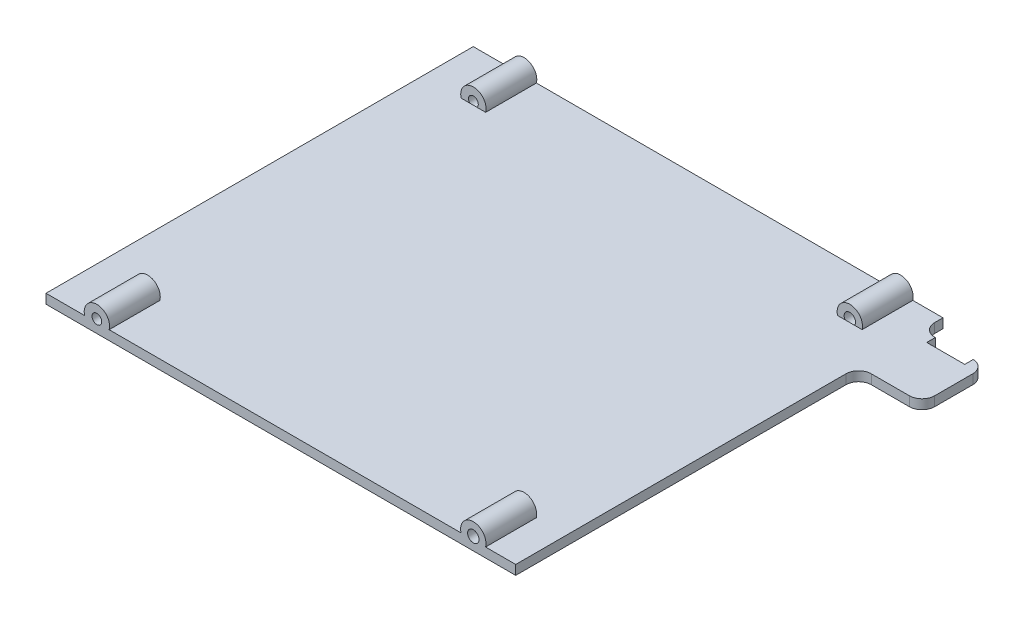
ISO-10303-21;
HEADER;
FILE_DESCRIPTION(('STEP AP214'),'2;1');
FILE_NAME('part.step','',(''),(''),'','','');
FILE_SCHEMA(('AUTOMOTIVE_DESIGN { 1 0 10303 214 1 1 1 1 }'));
ENDSEC;
DATA;
#1=APPLICATION_CONTEXT('core data for automotive mechanical design processes');
#2=APPLICATION_PROTOCOL_DEFINITION('international standard','automotive_design',2000,#1);
#3=PRODUCT_CONTEXT('',#1,'mechanical');
#4=PRODUCT('Part','Part','',(#3));
#5=PRODUCT_RELATED_PRODUCT_CATEGORY('part','',(#4));
#6=PRODUCT_DEFINITION_FORMATION('','',#4);
#7=PRODUCT_DEFINITION_CONTEXT('part definition',#1,'design');
#8=PRODUCT_DEFINITION('design','',#6,#7);
#9=PRODUCT_DEFINITION_SHAPE('','',#8);
#10=(LENGTH_UNIT() NAMED_UNIT(*) SI_UNIT(.MILLI.,.METRE.));
#11=(NAMED_UNIT(*) PLANE_ANGLE_UNIT() SI_UNIT($,.RADIAN.));
#12=(NAMED_UNIT(*) SI_UNIT($,.STERADIAN.) SOLID_ANGLE_UNIT());
#13=UNCERTAINTY_MEASURE_WITH_UNIT(LENGTH_MEASURE(1.E-05),#10,'distance_accuracy_value','');
#14=(GEOMETRIC_REPRESENTATION_CONTEXT(3) GLOBAL_UNCERTAINTY_ASSIGNED_CONTEXT((#13)) GLOBAL_UNIT_ASSIGNED_CONTEXT((#10,
#11,#12)) REPRESENTATION_CONTEXT('',''));
#15=CARTESIAN_POINT('',(0.,0.,0.));
#16=DIRECTION('',(0.,0.,1.));
#17=DIRECTION('',(1.,0.,0.));
#18=AXIS2_PLACEMENT_3D('',#15,#16,#17);
#19=CARTESIAN_POINT('',(-85.5905303741347,-18.8675075749451,-141.472563016622));
#20=DIRECTION('',(-1.,0.,0.));
#21=DIRECTION('',(0.,-1.,0.));
#22=AXIS2_PLACEMENT_3D('',#19,#20,#21);
#23=PLANE('',#22);
#24=DIRECTION('',(0.,0.999999944421007,0.000333403635094687));
#25=VECTOR('',#24,1.);
#26=CARTESIAN_POINT('',(-85.5905303741347,-20.3675075749451,-52.0805001054825));
#27=LINE('',#26,#25);
#28=CARTESIAN_POINT('',(-85.5905303741347,-20.3675075749451,-52.0805001054825));
#29=VERTEX_POINT('',#28);
#30=CARTESIAN_POINT('',(-85.5905303741347,-18.8675075749451,-52.080000000002));
#31=VERTEX_POINT('',#30);
#32=EDGE_CURVE('E253',#29,#31,#27,.T.);
#33=ORIENTED_EDGE('',*,*,#32,.T.);
#34=DIRECTION('',(0.,0.,1.));
#35=VECTOR('',#34,1.);
#36=CARTESIAN_POINT('',(-85.5905303741347,-18.8675075749451,-141.472563016622));
#37=LINE('',#36,#35);
#38=CARTESIAN_POINT('',(-85.5905303741347,-18.8675075749451,0.));
#39=VERTEX_POINT('',#38);
#40=EDGE_CURVE('E387',#31,#39,#37,.T.);
#41=ORIENTED_EDGE('',*,*,#40,.T.);
#42=DIRECTION('',(0.,1.,0.));
#43=VECTOR('',#42,1.);
#44=CARTESIAN_POINT('',(-85.5905303741347,-18.8675075749451,0.));
#45=LINE('',#44,#43);
#46=CARTESIAN_POINT('',(-85.5905303741347,-20.3675075749451,0.));
#47=VERTEX_POINT('',#46);
#48=EDGE_CURVE('E384',#47,#39,#45,.T.);
#49=ORIENTED_EDGE('',*,*,#48,.F.);
#50=DIRECTION('',(0.,0.,1.));
#51=VECTOR('',#50,1.);
#52=CARTESIAN_POINT('',(-85.5905303741347,-20.3675075749451,-141.472563016622));
#53=LINE('',#52,#51);
#54=EDGE_CURVE('E391',#29,#47,#53,.T.);
#55=ORIENTED_EDGE('',*,*,#54,.F.);
#56=EDGE_LOOP('',(#33,#41,#49,#55));
#57=FACE_BOUND('',#56,.T.);
#58=ADVANCED_FACE('F41',(#57),#23,.F.);
#59=CARTESIAN_POINT('',(-159.667908124511,-18.8675075749451,-141.472563016622));
#60=DIRECTION('',(0.,-1.,0.));
#61=DIRECTION('',(1.,0.,0.));
#62=AXIS2_PLACEMENT_3D('',#59,#60,#61);
#63=PLANE('',#62);
#64=DIRECTION('',(1.,0.,0.));
#65=VECTOR('',#64,1.);
#66=CARTESIAN_POINT('',(-159.667908124511,-18.8675075749451,-62.7311529803631));
#67=LINE('',#66,#65);
#68=CARTESIAN_POINT('',(-83.4954652130825,-18.8675075749451,-62.7311529803631));
#69=VERTEX_POINT('',#68);
#70=CARTESIAN_POINT('',(-77.5092926086521,-18.8675075749451,-62.7311529803631));
#71=VERTEX_POINT('',#70);
#72=EDGE_CURVE('E251',#69,#71,#67,.T.);
#73=ORIENTED_EDGE('',*,*,#72,.F.);
#74=DIRECTION('',(0.,0.,1.));
#75=VECTOR('',#74,1.);
#76=CARTESIAN_POINT('',(-83.4954652130825,-18.8675075749451,-141.472563016622));
#77=LINE('',#76,#75);
#78=CARTESIAN_POINT('',(-83.4954652130825,-18.8675075749449,-64.0800000000012));
#79=VERTEX_POINT('',#78);
#80=EDGE_CURVE('E227',#79,#69,#77,.T.);
#81=ORIENTED_EDGE('',*,*,#80,.F.);
#82=DIRECTION('',(-1.,0.,0.));
#83=VECTOR('',#82,1.);
#84=CARTESIAN_POINT('',(-33.147999999999,-18.8675075749446,-64.0800000000013));
#85=LINE('',#84,#83);
#86=CARTESIAN_POINT('',(-83.5905303741347,-18.8675075749451,-64.0800000000012));
#87=VERTEX_POINT('',#86);
#88=EDGE_CURVE('E270',#79,#87,#85,.T.);
#89=ORIENTED_EDGE('',*,*,#88,.T.);
#90=CARTESIAN_POINT('',(-83.5905303741347,-18.8675075749451,-66.0800000000012));
#91=DIRECTION('',(0.,1.,0.));
#92=DIRECTION('',(1.,0.,0.));
#93=AXIS2_PLACEMENT_3D('',#90,#91,#92);
#94=CIRCLE('',#93,2.);
#95=CARTESIAN_POINT('',(-85.5905303741347,-18.8675075749451,-66.0800000000012));
#96=VERTEX_POINT('',#95);
#97=EDGE_CURVE('E278',#96,#87,#94,.T.);
#98=ORIENTED_EDGE('',*,*,#97,.F.);
#99=CARTESIAN_POINT('',(-85.5905303741347,-18.8675075749451,-67.3800000000012));
#100=VERTEX_POINT('',#99);
#101=EDGE_CURVE('E406',#100,#96,#37,.T.);
#102=ORIENTED_EDGE('',*,*,#101,.F.);
#103=DIRECTION('',(-1.,0.,0.));
#104=VECTOR('',#103,1.);
#105=CARTESIAN_POINT('',(-159.667908124511,-18.8675075749451,-67.3800000000011));
#106=LINE('',#105,#104);
#107=CARTESIAN_POINT('',(-90.343870425704,-18.8675075749451,-67.3800000000013));
#108=VERTEX_POINT('',#107);
#109=EDGE_CURVE('E392',#100,#108,#106,.T.);
#110=ORIENTED_EDGE('',*,*,#109,.T.);
#111=DIRECTION('',(0.,0.,-1.));
#112=VECTOR('',#111,1.);
#113=CARTESIAN_POINT('',(-90.343870425704,-18.8675075749451,-59.3800000000013));
#114=LINE('',#113,#112);
#115=CARTESIAN_POINT('',(-90.343870425704,-18.8675075749451,-59.3800000000013));
#116=VERTEX_POINT('',#115);
#117=EDGE_CURVE('E325',#108,#116,#114,.F.);
#118=ORIENTED_EDGE('',*,*,#117,.T.);
#119=DIRECTION('',(1.,0.,0.));
#120=VECTOR('',#119,1.);
#121=CARTESIAN_POINT('',(-159.667908124511,-18.8675075749451,-59.3800000000013));
#122=LINE('',#121,#120);
#123=CARTESIAN_POINT('',(-91.5320306214525,-18.8675075749451,-59.3800000000013));
#124=VERTEX_POINT('',#123);
#125=EDGE_CURVE('E334',#124,#116,#122,.T.);
#126=ORIENTED_EDGE('',*,*,#125,.F.);
#127=CARTESIAN_POINT('',(-93.028693576163,-18.8675075749451,-59.3800000000013));
#128=VERTEX_POINT('',#127);
#129=EDGE_CURVE('E339',#128,#124,#122,.T.);
#130=ORIENTED_EDGE('',*,*,#129,.F.);
#131=CARTESIAN_POINT('',(-94.216853771912,-18.8675075749451,-59.3800000000013));
#132=VERTEX_POINT('',#131);
#133=EDGE_CURVE('E335',#132,#128,#122,.T.);
#134=ORIENTED_EDGE('',*,*,#133,.F.);
#135=DIRECTION('',(0.,0.,-1.));
#136=VECTOR('',#135,1.);
#137=CARTESIAN_POINT('',(-94.216853771912,-18.8675075749451,-59.3800000000013));
#138=LINE('',#137,#136);
#139=CARTESIAN_POINT('',(-94.216853771912,-18.8675075749451,-67.3800000000012));
#140=VERTEX_POINT('',#139);
#141=EDGE_CURVE('E317',#132,#140,#138,.T.);
#142=ORIENTED_EDGE('',*,*,#141,.T.);
#143=CARTESIAN_POINT('',(-149.708016259504,-18.8675075749451,-67.3800000000013));
#144=VERTEX_POINT('',#143);
#145=EDGE_CURVE('E396',#140,#144,#106,.T.);
#146=ORIENTED_EDGE('',*,*,#145,.T.);
#147=DIRECTION('',(0.,0.,-1.));
#148=VECTOR('',#147,1.);
#149=CARTESIAN_POINT('',(-149.708016259504,-18.8675075749451,-59.3800000000013));
#150=LINE('',#149,#148);
#151=CARTESIAN_POINT('',(-149.708016259504,-18.8675075749451,-59.3800000000013));
#152=VERTEX_POINT('',#151);
#153=EDGE_CURVE('E331',#144,#152,#150,.F.);
#154=ORIENTED_EDGE('',*,*,#153,.T.);
#155=DIRECTION('',(1.,0.,0.));
#156=VECTOR('',#155,1.);
#157=CARTESIAN_POINT('',(-159.667908124511,-18.8675075749451,-59.3800000000013));
#158=LINE('',#157,#156);
#159=CARTESIAN_POINT('',(-151.059398233736,-18.8675075749451,-59.3800000000013));
#160=VERTEX_POINT('',#159);
#161=EDGE_CURVE('E338',#160,#152,#158,.T.);
#162=ORIENTED_EDGE('',*,*,#161,.F.);
#163=CARTESIAN_POINT('',(-152.22961763148,-18.8675075749451,-59.3800000000013));
#164=VERTEX_POINT('',#163);
#165=EDGE_CURVE('E344',#164,#160,#158,.T.);
#166=ORIENTED_EDGE('',*,*,#165,.F.);
#167=CARTESIAN_POINT('',(-153.580999605713,-18.8675075749451,-59.3800000000013));
#168=VERTEX_POINT('',#167);
#169=EDGE_CURVE('E340',#168,#164,#158,.T.);
#170=ORIENTED_EDGE('',*,*,#169,.F.);
#171=DIRECTION('',(0.,0.,-1.));
#172=VECTOR('',#171,1.);
#173=CARTESIAN_POINT('',(-153.580999605713,-18.8675075749451,-59.3800000000013));
#174=LINE('',#173,#172);
#175=CARTESIAN_POINT('',(-153.580999605713,-18.8675075749451,-67.3800000000011));
#176=VERTEX_POINT('',#175);
#177=EDGE_CURVE('E328',#168,#176,#174,.T.);
#178=ORIENTED_EDGE('',*,*,#177,.T.);
#179=CARTESIAN_POINT('',(-159.667908124511,-18.8675075749451,-67.3800000000011));
#180=VERTEX_POINT('',#179);
#181=EDGE_CURVE('E397',#176,#180,#106,.T.);
#182=ORIENTED_EDGE('',*,*,#181,.T.);
#183=DIRECTION('',(0.,0.,1.));
#184=VECTOR('',#183,1.);
#185=CARTESIAN_POINT('',(-159.667908124511,-18.8675075749451,-141.472563016622));
#186=LINE('',#185,#184);
#187=CARTESIAN_POINT('',(-159.667908124511,-18.8675075749451,0.));
#188=VERTEX_POINT('',#187);
#189=EDGE_CURVE('E378',#180,#188,#186,.T.);
#190=ORIENTED_EDGE('',*,*,#189,.T.);
#191=DIRECTION('',(-1.,0.,0.));
#192=VECTOR('',#191,1.);
#193=CARTESIAN_POINT('',(-159.667908124511,-18.8675075749451,0.));
#194=LINE('',#193,#192);
#195=CARTESIAN_POINT('',(-153.580999605712,-18.8675075749451,0.));
#196=VERTEX_POINT('',#195);
#197=EDGE_CURVE('E383',#196,#188,#194,.T.);
#198=ORIENTED_EDGE('',*,*,#197,.F.);
#199=DIRECTION('',(0.,0.,1.));
#200=VECTOR('',#199,1.);
#201=CARTESIAN_POINT('',(-153.580999605712,-18.8675075749451,-8.));
#202=LINE('',#201,#200);
#203=CARTESIAN_POINT('',(-153.580999605712,-18.8675075749451,-8.));
#204=VERTEX_POINT('',#203);
#205=EDGE_CURVE('E371',#196,#204,#202,.F.);
#206=ORIENTED_EDGE('',*,*,#205,.T.);
#207=DIRECTION('',(-1.,0.,0.));
#208=VECTOR('',#207,1.);
#209=CARTESIAN_POINT('',(-159.667908124511,-18.8675075749451,-8.00000000000001));
#210=LINE('',#209,#208);
#211=CARTESIAN_POINT('',(-152.22961763148,-18.8675075749451,-8.));
#212=VERTEX_POINT('',#211);
#213=EDGE_CURVE('E416',#212,#204,#210,.T.);
#214=ORIENTED_EDGE('',*,*,#213,.F.);
#215=CARTESIAN_POINT('',(-151.059398233736,-18.8675075749451,-8.));
#216=VERTEX_POINT('',#215);
#217=EDGE_CURVE('E422',#216,#212,#210,.T.);
#218=ORIENTED_EDGE('',*,*,#217,.F.);
#219=CARTESIAN_POINT('',(-149.708016259504,-18.8675075749451,-8.));
#220=VERTEX_POINT('',#219);
#221=EDGE_CURVE('E418',#220,#216,#210,.T.);
#222=ORIENTED_EDGE('',*,*,#221,.F.);
#223=DIRECTION('',(0.,0.,1.));
#224=VECTOR('',#223,1.);
#225=CARTESIAN_POINT('',(-149.708016259504,-18.8675075749451,-8.));
#226=LINE('',#225,#224);
#227=CARTESIAN_POINT('',(-149.708016259504,-18.8675075749451,0.));
#228=VERTEX_POINT('',#227);
#229=EDGE_CURVE('E368',#220,#228,#226,.T.);
#230=ORIENTED_EDGE('',*,*,#229,.T.);
#231=CARTESIAN_POINT('',(-94.2168537719112,-18.8675075749451,0.));
#232=VERTEX_POINT('',#231);
#233=EDGE_CURVE('E382',#232,#228,#194,.T.);
#234=ORIENTED_EDGE('',*,*,#233,.F.);
#235=DIRECTION('',(0.,0.,1.));
#236=VECTOR('',#235,1.);
#237=CARTESIAN_POINT('',(-94.2168537719112,-18.8675075749451,-8.));
#238=LINE('',#237,#236);
#239=CARTESIAN_POINT('',(-94.2168537719112,-18.8675075749451,-8.));
#240=VERTEX_POINT('',#239);
#241=EDGE_CURVE('E365',#232,#240,#238,.F.);
#242=ORIENTED_EDGE('',*,*,#241,.T.);
#243=DIRECTION('',(-1.,0.,0.));
#244=VECTOR('',#243,1.);
#245=CARTESIAN_POINT('',(-159.667908124511,-18.8675075749451,-8.00000000000001));
#246=LINE('',#245,#244);
#247=CARTESIAN_POINT('',(-93.0286935761624,-18.8675075749451,-8.));
#248=VERTEX_POINT('',#247);
#249=EDGE_CURVE('E395',#248,#240,#246,.T.);
#250=ORIENTED_EDGE('',*,*,#249,.F.);
#251=CARTESIAN_POINT('',(-91.5320306214526,-18.8675075749451,-8.));
#252=VERTEX_POINT('',#251);
#253=EDGE_CURVE('E417',#252,#248,#246,.T.);
#254=ORIENTED_EDGE('',*,*,#253,.F.);
#255=CARTESIAN_POINT('',(-90.3438704257039,-18.8675075749451,-8.));
#256=VERTEX_POINT('',#255);
#257=EDGE_CURVE('E413',#256,#252,#246,.T.);
#258=ORIENTED_EDGE('',*,*,#257,.F.);
#259=DIRECTION('',(0.,0.,1.));
#260=VECTOR('',#259,1.);
#261=CARTESIAN_POINT('',(-90.3438704257039,-18.8675075749451,-8.));
#262=LINE('',#261,#260);
#263=CARTESIAN_POINT('',(-90.3438704257039,-18.8675075749451,0.));
#264=VERTEX_POINT('',#263);
#265=EDGE_CURVE('E357',#256,#264,#262,.T.);
#266=ORIENTED_EDGE('',*,*,#265,.T.);
#267=EDGE_CURVE('E379',#39,#264,#194,.T.);
#268=ORIENTED_EDGE('',*,*,#267,.F.);
#269=ORIENTED_EDGE('',*,*,#40,.F.);
#270=CARTESIAN_POINT('',(-83.5905303741347,-18.8675075749451,-52.0800000000021));
#271=DIRECTION('',(0.,1.,0.));
#272=DIRECTION('',(1.,0.,0.));
#273=AXIS2_PLACEMENT_3D('',#270,#271,#272);
#274=CIRCLE('',#273,2.);
#275=CARTESIAN_POINT('',(-83.5905303741347,-18.8675075749451,-54.0800000000021));
#276=VERTEX_POINT('',#275);
#277=EDGE_CURVE('E63',#276,#31,#274,.T.);
#278=ORIENTED_EDGE('',*,*,#277,.F.);
#279=DIRECTION('',(1.,0.,0.));
#280=VECTOR('',#279,1.);
#281=CARTESIAN_POINT('',(-33.1479999999989,-18.8675075749446,-54.0800000000021));
#282=LINE('',#281,#280);
#283=CARTESIAN_POINT('',(-77.5905303741347,-18.867507574945,-54.0800000000021));
#284=VERTEX_POINT('',#283);
#285=EDGE_CURVE('E258',#276,#284,#282,.T.);
#286=ORIENTED_EDGE('',*,*,#285,.T.);
#287=CARTESIAN_POINT('',(-77.5905303741347,-18.867507574945,-56.0800000000021));
#288=DIRECTION('',(0.,1.,0.));
#289=DIRECTION('',(1.,0.,0.));
#290=AXIS2_PLACEMENT_3D('',#287,#288,#289);
#291=CIRCLE('',#290,2.);
#292=CARTESIAN_POINT('',(-75.5905303741347,-18.867507574945,-56.0800000000021));
#293=VERTEX_POINT('',#292);
#294=EDGE_CURVE('E261',#284,#293,#291,.T.);
#295=ORIENTED_EDGE('',*,*,#294,.T.);
#296=DIRECTION('',(0.,0.,-1.));
#297=VECTOR('',#296,1.);
#298=CARTESIAN_POINT('',(-75.5905303741347,-18.867507574945,-52.080000000002));
#299=LINE('',#298,#297);
#300=CARTESIAN_POINT('',(-75.5905303741347,-18.867507574945,-62.0800000000012));
#301=VERTEX_POINT('',#300);
#302=EDGE_CURVE('E264',#293,#301,#299,.T.);
#303=ORIENTED_EDGE('',*,*,#302,.T.);
#304=CARTESIAN_POINT('',(-77.5905303741347,-18.867507574945,-62.0800000000012));
#305=DIRECTION('',(0.,1.,0.));
#306=DIRECTION('',(1.,0.,0.));
#307=AXIS2_PLACEMENT_3D('',#304,#305,#306);
#308=CIRCLE('',#307,2.);
#309=CARTESIAN_POINT('',(-77.5092926086521,-18.8675075749449,-64.0783494252668));
#310=VERTEX_POINT('',#309);
#311=EDGE_CURVE('E267',#301,#310,#308,.T.);
#312=ORIENTED_EDGE('',*,*,#311,.T.);
#313=DIRECTION('',(0.,0.,-1.));
#314=VECTOR('',#313,1.);
#315=CARTESIAN_POINT('',(-77.5092926086521,-18.8675075749451,-141.472563016622));
#316=LINE('',#315,#314);
#317=EDGE_CURVE('E247',#71,#310,#316,.T.);
#318=ORIENTED_EDGE('',*,*,#317,.F.);
#319=EDGE_LOOP('',(#73,#81,#89,#98,#102,#110,#118,#126,#130,#134,#142,#146,#154,#162,#166,#170,
#178,#182,#190,#198,#206,#214,#218,#222,#230,#234,#242,#250,#254,#258,#266,#268,#269,#278,#286,
#295,#303,#312,#318));
#320=FACE_BOUND('',#319,.T.);
#321=ADVANCED_FACE('F440',(#320),#63,.F.);
#322=CARTESIAN_POINT('',(-85.5905303741347,-20.3675075749451,-141.472563016622));
#323=DIRECTION('',(0.,1.,0.));
#324=DIRECTION('',(-1.,0.,0.));
#325=AXIS2_PLACEMENT_3D('',#322,#323,#324);
#326=PLANE('',#325);
#327=CARTESIAN_POINT('',(-77.5905303741347,-20.3675075749451,-62.0800000000012));
#328=DIRECTION('',(0.,-1.,0.));
#329=DIRECTION('',(-1.,0.,0.));
#330=AXIS2_PLACEMENT_3D('',#327,#328,#329);
#331=CIRCLE('',#330,2.);
#332=CARTESIAN_POINT('',(-77.5092926086521,-20.3675075749451,-64.0783494252668));
#333=VERTEX_POINT('',#332);
#334=CARTESIAN_POINT('',(-75.5905303741347,-20.3675075749451,-62.0800000000012));
#335=VERTEX_POINT('',#334);
#336=EDGE_CURVE('E284',#333,#335,#331,.T.);
#337=ORIENTED_EDGE('',*,*,#336,.T.);
#338=DIRECTION('',(0.,0.,1.));
#339=VECTOR('',#338,1.);
#340=CARTESIAN_POINT('',(-75.5905303741347,-20.3675075749451,-64.0800000000021));
#341=LINE('',#340,#339);
#342=CARTESIAN_POINT('',(-75.5905303741347,-20.3675075749451,-56.0800000000021));
#343=VERTEX_POINT('',#342);
#344=EDGE_CURVE('E286',#335,#343,#341,.T.);
#345=ORIENTED_EDGE('',*,*,#344,.T.);
#346=CARTESIAN_POINT('',(-77.5905303741347,-20.3675075749451,-56.0800000000021));
#347=DIRECTION('',(0.,-1.,0.));
#348=DIRECTION('',(-1.,0.,0.));
#349=AXIS2_PLACEMENT_3D('',#346,#347,#348);
#350=CIRCLE('',#349,2.);
#351=CARTESIAN_POINT('',(-77.5905303741347,-20.3675075749451,-54.0800000000021));
#352=VERTEX_POINT('',#351);
#353=EDGE_CURVE('E273',#343,#352,#350,.T.);
#354=ORIENTED_EDGE('',*,*,#353,.T.);
#355=DIRECTION('',(-1.,0.,0.));
#356=VECTOR('',#355,1.);
#357=CARTESIAN_POINT('',(-75.5905303741347,-20.3675075749451,-54.0800000000021));
#358=LINE('',#357,#356);
#359=CARTESIAN_POINT('',(-83.5905303741347,-20.3675075749451,-54.0800000000021));
#360=VERTEX_POINT('',#359);
#361=EDGE_CURVE('E277',#352,#360,#358,.T.);
#362=ORIENTED_EDGE('',*,*,#361,.T.);
#363=CARTESIAN_POINT('',(-83.5905303741347,-20.3675075749451,-52.0800000000021));
#364=DIRECTION('',(0.,-1.,0.));
#365=DIRECTION('',(-1.,0.,0.));
#366=AXIS2_PLACEMENT_3D('',#363,#364,#365);
#367=CIRCLE('',#366,2.);
#368=EDGE_CURVE('E274',#29,#360,#367,.T.);
#369=ORIENTED_EDGE('',*,*,#368,.F.);
#370=ORIENTED_EDGE('',*,*,#54,.T.);
#371=DIRECTION('',(1.,0.,0.));
#372=VECTOR('',#371,1.);
#373=CARTESIAN_POINT('',(-85.5905303741347,-20.3675075749451,0.));
#374=LINE('',#373,#372);
#375=CARTESIAN_POINT('',(-159.667908124511,-20.3675075749451,0.));
#376=VERTEX_POINT('',#375);
#377=EDGE_CURVE('E389',#376,#47,#374,.T.);
#378=ORIENTED_EDGE('',*,*,#377,.F.);
#379=DIRECTION('',(0.,0.,1.));
#380=VECTOR('',#379,1.);
#381=CARTESIAN_POINT('',(-159.667908124511,-20.3675075749451,-141.472563016622));
#382=LINE('',#381,#380);
#383=CARTESIAN_POINT('',(-159.667908124511,-20.3675075749451,-67.3800000000011));
#384=VERTEX_POINT('',#383);
#385=EDGE_CURVE('E374',#384,#376,#382,.T.);
#386=ORIENTED_EDGE('',*,*,#385,.F.);
#387=DIRECTION('',(1.,0.,0.));
#388=VECTOR('',#387,1.);
#389=CARTESIAN_POINT('',(-85.5905303741346,-20.3675075749451,-67.3800000000012));
#390=LINE('',#389,#388);
#391=CARTESIAN_POINT('',(-85.5905303741347,-20.3675075749451,-67.3800000000012));
#392=VERTEX_POINT('',#391);
#393=EDGE_CURVE('E400',#384,#392,#390,.T.);
#394=ORIENTED_EDGE('',*,*,#393,.T.);
#395=CARTESIAN_POINT('',(-85.5905303741347,-20.3675075749451,-66.0800000000012));
#396=VERTEX_POINT('',#395);
#397=EDGE_CURVE('E388',#392,#396,#53,.T.);
#398=ORIENTED_EDGE('',*,*,#397,.T.);
#399=CARTESIAN_POINT('',(-83.5905303741347,-20.3675075749451,-66.0800000000012));
#400=DIRECTION('',(0.,-1.,0.));
#401=DIRECTION('',(-1.,0.,0.));
#402=AXIS2_PLACEMENT_3D('',#399,#400,#401);
#403=CIRCLE('',#402,2.);
#404=CARTESIAN_POINT('',(-83.5905303741347,-20.3675075749451,-64.080000000002));
#405=VERTEX_POINT('',#404);
#406=EDGE_CURVE('E281',#396,#405,#403,.F.);
#407=ORIENTED_EDGE('',*,*,#406,.T.);
#408=DIRECTION('',(1.,0.,0.));
#409=VECTOR('',#408,1.);
#410=CARTESIAN_POINT('',(-85.5905303741347,-20.3675075749451,-64.080000000002));
#411=LINE('',#410,#409);
#412=CARTESIAN_POINT('',(-83.4954652130825,-20.3675075749454,-64.0800000000012));
#413=VERTEX_POINT('',#412);
#414=EDGE_CURVE('E243',#405,#413,#411,.T.);
#415=ORIENTED_EDGE('',*,*,#414,.T.);
#416=DIRECTION('',(0.,0.,1.));
#417=VECTOR('',#416,1.);
#418=CARTESIAN_POINT('',(-83.4954652130825,-20.3675075749454,-66.6522392252637));
#419=LINE('',#418,#417);
#420=CARTESIAN_POINT('',(-83.4954652130825,-20.3675075749454,-62.7311529803631));
#421=VERTEX_POINT('',#420);
#422=EDGE_CURVE('E224',#413,#421,#419,.T.);
#423=ORIENTED_EDGE('',*,*,#422,.T.);
#424=DIRECTION('',(1.,0.,0.));
#425=VECTOR('',#424,1.);
#426=CARTESIAN_POINT('',(-83.4954652130825,-20.3675075749454,-62.7311529803631));
#427=LINE('',#426,#425);
#428=CARTESIAN_POINT('',(-77.5092926086521,-20.3675075749454,-62.7311529803631));
#429=VERTEX_POINT('',#428);
#430=EDGE_CURVE('E235',#421,#429,#427,.T.);
#431=ORIENTED_EDGE('',*,*,#430,.T.);
#432=DIRECTION('',(0.,0.,-1.));
#433=VECTOR('',#432,1.);
#434=CARTESIAN_POINT('',(-77.5092926086521,-20.3675075749454,-62.7311529803631));
#435=LINE('',#434,#433);
#436=EDGE_CURVE('E232',#429,#333,#435,.T.);
#437=ORIENTED_EDGE('',*,*,#436,.T.);
#438=EDGE_LOOP('',(#337,#345,#354,#362,#369,#370,#378,#386,#394,#398,#407,#415,#423,#431,#437));
#439=FACE_BOUND('',#438,.T.);
#440=ADVANCED_FACE('F240',(#439),#326,.F.);
#441=ORIENTED_EDGE('',*,*,#397,.F.);
#442=DIRECTION('',(0.,1.,0.));
#443=VECTOR('',#442,1.);
#444=CARTESIAN_POINT('',(-85.5905303741347,-18.8675075749451,-67.3800000000012));
#445=LINE('',#444,#443);
#446=EDGE_CURVE('E398',#392,#100,#445,.T.);
#447=ORIENTED_EDGE('',*,*,#446,.T.);
#448=ORIENTED_EDGE('',*,*,#101,.T.);
#449=DIRECTION('',(0.,1.,0.));
#450=VECTOR('',#449,1.);
#451=CARTESIAN_POINT('',(-85.5905303741347,19.6324924250549,-66.0800000000012));
#452=LINE('',#451,#450);
#453=EDGE_CURVE('E257',#96,#396,#452,.F.);
#454=ORIENTED_EDGE('',*,*,#453,.T.);
#455=EDGE_LOOP('',(#441,#447,#448,#454));
#456=FACE_BOUND('',#455,.T.);
#457=ADVANCED_FACE('F475',(#456),#23,.F.);
#458=CARTESIAN_POINT('',(-159.667908124511,-20.3675075749451,-141.472563016622));
#459=DIRECTION('',(1.,0.,0.));
#460=DIRECTION('',(0.,0.,1.));
#461=AXIS2_PLACEMENT_3D('',#458,#459,#460);
#462=PLANE('',#461);
#463=DIRECTION('',(0.,-1.,0.));
#464=VECTOR('',#463,1.);
#465=CARTESIAN_POINT('',(-159.667908124511,-20.3675075749451,-67.3800000000011));
#466=LINE('',#465,#464);
#467=EDGE_CURVE('E377',#180,#384,#466,.T.);
#468=ORIENTED_EDGE('',*,*,#467,.T.);
#469=ORIENTED_EDGE('',*,*,#385,.T.);
#470=DIRECTION('',(0.,-1.,0.));
#471=VECTOR('',#470,1.);
#472=CARTESIAN_POINT('',(-159.667908124511,-20.3675075749451,0.));
#473=LINE('',#472,#471);
#474=EDGE_CURVE('E375',#188,#376,#473,.T.);
#475=ORIENTED_EDGE('',*,*,#474,.F.);
#476=ORIENTED_EDGE('',*,*,#189,.F.);
#477=EDGE_LOOP('',(#468,#469,#475,#476));
#478=FACE_BOUND('',#477,.T.);
#479=ADVANCED_FACE('F466',(#478),#462,.F.);
#480=CARTESIAN_POINT('',(0.,0.,0.));
#481=DIRECTION('',(0.,0.,1.));
#482=DIRECTION('',(-1.,0.,0.));
#483=AXIS2_PLACEMENT_3D('',#480,#481,#482);
#484=PLANE('',#483);
#485=CARTESIAN_POINT('',(-151.644507932608,-18.3675075749456,0.));
#486=DIRECTION('',(0.,0.,-1.));
#487=DIRECTION('',(-1.,0.,0.));
#488=AXIS2_PLACEMENT_3D('',#485,#486,#487);
#489=CIRCLE('',#488,0.769644956920995);
#490=CARTESIAN_POINT('',(-152.414152889529,-18.3675075749456,0.));
#491=VERTEX_POINT('',#490);
#492=EDGE_CURVE('E345',#491,#491,#489,.T.);
#493=ORIENTED_EDGE('',*,*,#492,.T.);
#494=EDGE_LOOP('',(#493));
#495=FACE_BOUND('',#494,.T.);
#496=CARTESIAN_POINT('',(-92.2803620988075,-18.3675075749452,0.));
#497=DIRECTION('',(0.,0.,-1.));
#498=DIRECTION('',(-1.,0.,0.));
#499=AXIS2_PLACEMENT_3D('',#496,#497,#498);
#500=CIRCLE('',#499,0.900000000000003);
#501=CARTESIAN_POINT('',(-93.1803620988075,-18.3675075749452,0.));
#502=VERTEX_POINT('',#501);
#503=EDGE_CURVE('E349',#502,#502,#500,.T.);
#504=ORIENTED_EDGE('',*,*,#503,.T.);
#505=EDGE_LOOP('',(#504));
#506=FACE_BOUND('',#505,.T.);
#507=ORIENTED_EDGE('',*,*,#48,.T.);
#508=ORIENTED_EDGE('',*,*,#267,.T.);
#509=CARTESIAN_POINT('',(-92.2803620988075,-18.3675075749452,0.));
#510=DIRECTION('',(0.,0.,1.));
#511=DIRECTION('',(1.,0.,0.));
#512=AXIS2_PLACEMENT_3D('',#509,#510,#511);
#513=CIRCLE('',#512,1.99999999999992);
#514=EDGE_CURVE('E360',#264,#232,#513,.T.);
#515=ORIENTED_EDGE('',*,*,#514,.T.);
#516=ORIENTED_EDGE('',*,*,#233,.T.);
#517=CARTESIAN_POINT('',(-151.644507932608,-18.3675075749453,0.));
#518=DIRECTION('',(0.,0.,1.));
#519=DIRECTION('',(1.,0.,0.));
#520=AXIS2_PLACEMENT_3D('',#517,#518,#519);
#521=CIRCLE('',#520,2.00000000000008);
#522=EDGE_CURVE('E358',#228,#196,#521,.T.);
#523=ORIENTED_EDGE('',*,*,#522,.T.);
#524=ORIENTED_EDGE('',*,*,#197,.T.);
#525=ORIENTED_EDGE('',*,*,#474,.T.);
#526=ORIENTED_EDGE('',*,*,#377,.T.);
#527=EDGE_LOOP('',(#507,#508,#515,#516,#523,#524,#525,#526));
#528=FACE_BOUND('',#527,.T.);
#529=ADVANCED_FACE('F461',(#495,#506,#528),#484,.T.);
#530=CARTESIAN_POINT('',(-53.15,-0.367507574945569,-67.3800000000013));
#531=DIRECTION('',(0.,0.,-1.));
#532=DIRECTION('',(0.999885624174656,-0.0151241055556286,0.));
#533=AXIS2_PLACEMENT_3D('',#530,#531,#532);
#534=PLANE('',#533);
#535=CARTESIAN_POINT('',(-92.2803620988078,-18.3675075749455,-67.3800000000013));
#536=DIRECTION('',(0.,0.,-1.));
#537=DIRECTION('',(0.,1.,0.));
#538=AXIS2_PLACEMENT_3D('',#535,#536,#537);
#539=CIRCLE('',#538,0.900000000000158);
#540=CARTESIAN_POINT('',(-92.2803620988078,-17.4675075749454,-67.3800000000013));
#541=VERTEX_POINT('',#540);
#542=EDGE_CURVE('E305',#541,#541,#539,.T.);
#543=ORIENTED_EDGE('',*,*,#542,.F.);
#544=EDGE_LOOP('',(#543));
#545=FACE_BOUND('',#544,.T.);
#546=CARTESIAN_POINT('',(-151.644507932608,-18.3675075749455,-67.3800000000013));
#547=DIRECTION('',(0.,0.,-1.));
#548=DIRECTION('',(0.,1.,0.));
#549=AXIS2_PLACEMENT_3D('',#546,#547,#548);
#550=CIRCLE('',#549,0.769644956920995);
#551=CARTESIAN_POINT('',(-151.644507932608,-17.5978626180245,-67.3800000000013));
#552=VERTEX_POINT('',#551);
#553=EDGE_CURVE('E293',#552,#552,#550,.T.);
#554=ORIENTED_EDGE('',*,*,#553,.F.);
#555=EDGE_LOOP('',(#554));
#556=FACE_BOUND('',#555,.T.);
#557=ORIENTED_EDGE('',*,*,#393,.F.);
#558=ORIENTED_EDGE('',*,*,#467,.F.);
#559=ORIENTED_EDGE('',*,*,#181,.F.);
#560=CARTESIAN_POINT('',(-151.644507932608,-18.3675075749456,-67.3800000000013));
#561=DIRECTION('',(0.,0.,-1.));
#562=DIRECTION('',(0.,1.,0.));
#563=AXIS2_PLACEMENT_3D('',#560,#561,#562);
#564=CIRCLE('',#563,2.00000000000039);
#565=EDGE_CURVE('E318',#176,#144,#564,.T.);
#566=ORIENTED_EDGE('',*,*,#565,.T.);
#567=ORIENTED_EDGE('',*,*,#145,.F.);
#568=CARTESIAN_POINT('',(-92.280362098808,-18.3675075749455,-67.3800000000013));
#569=DIRECTION('',(0.,0.,-1.));
#570=DIRECTION('',(0.,1.,0.));
#571=AXIS2_PLACEMENT_3D('',#568,#569,#570);
#572=CIRCLE('',#571,2.00000000000021);
#573=EDGE_CURVE('E320',#140,#108,#572,.T.);
#574=ORIENTED_EDGE('',*,*,#573,.T.);
#575=ORIENTED_EDGE('',*,*,#109,.F.);
#576=ORIENTED_EDGE('',*,*,#446,.F.);
#577=EDGE_LOOP('',(#557,#558,#559,#566,#567,#574,#575,#576));
#578=FACE_BOUND('',#577,.T.);
#579=ADVANCED_FACE('F43',(#545,#556,#578),#534,.T.);
#580=CARTESIAN_POINT('',(-92.2803620988075,-18.3675075749452,-8.));
#581=DIRECTION('',(0.,0.,-1.));
#582=DIRECTION('',(1.,0.,0.));
#583=AXIS2_PLACEMENT_3D('',#580,#581,#582);
#584=PLANE('',#583);
#585=CARTESIAN_POINT('',(-92.2803620988075,-18.3675075749452,-8.));
#586=DIRECTION('',(0.,0.,1.));
#587=DIRECTION('',(1.,0.,0.));
#588=AXIS2_PLACEMENT_3D('',#585,#586,#587);
#589=CIRCLE('',#588,0.900000000000003);
#590=EDGE_CURVE('E425',#252,#248,#589,.T.);
#591=ORIENTED_EDGE('',*,*,#590,.T.);
#592=ORIENTED_EDGE('',*,*,#249,.T.);
#593=CARTESIAN_POINT('',(-92.2803620988075,-18.3675075749452,-8.));
#594=DIRECTION('',(0.,0.,1.));
#595=DIRECTION('',(1.,0.,0.));
#596=AXIS2_PLACEMENT_3D('',#593,#594,#595);
#597=CIRCLE('',#596,1.99999999999992);
#598=EDGE_CURVE('E351',#256,#240,#597,.T.);
#599=ORIENTED_EDGE('',*,*,#598,.F.);
#600=ORIENTED_EDGE('',*,*,#257,.T.);
#601=EDGE_LOOP('',(#591,#592,#599,#600));
#602=FACE_BOUND('',#601,.T.);
#603=ADVANCED_FACE('F717',(#602),#584,.T.);
#604=CARTESIAN_POINT('',(-92.2803620988075,-18.3675075749452,-8.));
#605=DIRECTION('',(0.,0.,1.));
#606=DIRECTION('',(-1.,0.,0.));
#607=AXIS2_PLACEMENT_3D('',#604,#605,#606);
#608=CYLINDRICAL_SURFACE('',#607,1.99999999999992);
#609=ORIENTED_EDGE('',*,*,#514,.F.);
#610=ORIENTED_EDGE('',*,*,#265,.F.);
#611=ORIENTED_EDGE('',*,*,#598,.T.);
#612=ORIENTED_EDGE('',*,*,#241,.F.);
#613=EDGE_LOOP('',(#609,#610,#611,#612));
#614=FACE_BOUND('',#613,.T.);
#615=ADVANCED_FACE('F708',(#614),#608,.T.);
#616=CARTESIAN_POINT('',(-151.644507932608,-18.3675075749453,-8.));
#617=DIRECTION('',(0.,0.,-1.));
#618=DIRECTION('',(1.,0.,0.));
#619=AXIS2_PLACEMENT_3D('',#616,#617,#618);
#620=PLANE('',#619);
#621=CARTESIAN_POINT('',(-151.644507932608,-18.3675075749456,-8.));
#622=DIRECTION('',(0.,0.,1.));
#623=DIRECTION('',(1.,0.,0.));
#624=AXIS2_PLACEMENT_3D('',#621,#622,#623);
#625=CIRCLE('',#624,0.769644956920995);
#626=EDGE_CURVE('E421',#216,#212,#625,.T.);
#627=ORIENTED_EDGE('',*,*,#626,.T.);
#628=ORIENTED_EDGE('',*,*,#213,.T.);
#629=CARTESIAN_POINT('',(-151.644507932608,-18.3675075749453,-8.));
#630=DIRECTION('',(0.,0.,1.));
#631=DIRECTION('',(1.,0.,0.));
#632=AXIS2_PLACEMENT_3D('',#629,#630,#631);
#633=CIRCLE('',#632,2.00000000000008);
#634=EDGE_CURVE('E355',#220,#204,#633,.T.);
#635=ORIENTED_EDGE('',*,*,#634,.F.);
#636=ORIENTED_EDGE('',*,*,#221,.T.);
#637=EDGE_LOOP('',(#627,#628,#635,#636));
#638=FACE_BOUND('',#637,.T.);
#639=ADVANCED_FACE('F586',(#638),#620,.T.);
#640=CARTESIAN_POINT('',(-151.644507932608,-18.3675075749453,-8.));
#641=DIRECTION('',(0.,0.,1.));
#642=DIRECTION('',(-1.,0.,0.));
#643=AXIS2_PLACEMENT_3D('',#640,#641,#642);
#644=CYLINDRICAL_SURFACE('',#643,2.00000000000008);
#645=ORIENTED_EDGE('',*,*,#522,.F.);
#646=ORIENTED_EDGE('',*,*,#229,.F.);
#647=ORIENTED_EDGE('',*,*,#634,.T.);
#648=ORIENTED_EDGE('',*,*,#205,.F.);
#649=EDGE_LOOP('',(#645,#646,#647,#648));
#650=FACE_BOUND('',#649,.T.);
#651=ADVANCED_FACE('F567',(#650),#644,.T.);
#652=CARTESIAN_POINT('',(-92.2803620988075,-18.3675075749452,-8.));
#653=DIRECTION('',(0.,0.,-1.));
#654=DIRECTION('',(1.,0.,0.));
#655=AXIS2_PLACEMENT_3D('',#652,#653,#654);
#656=PLANE('',#655);
#657=CARTESIAN_POINT('',(-151.644507932608,-18.3675075749456,-8.));
#658=DIRECTION('',(0.,0.,1.));
#659=DIRECTION('',(1.,0.,0.));
#660=AXIS2_PLACEMENT_3D('',#657,#658,#659);
#661=CIRCLE('',#660,0.769644956920995);
#662=EDGE_CURVE('E348',#216,#212,#661,.F.);
#663=ORIENTED_EDGE('',*,*,#662,.F.);
#664=ORIENTED_EDGE('',*,*,#217,.T.);
#665=EDGE_LOOP('',(#663,#664));
#666=FACE_BOUND('',#665,.T.);
#667=ADVANCED_FACE('F561',(#666),#656,.F.);
#668=CARTESIAN_POINT('',(-151.644507932608,-18.3675075749456,-10.5455844122716));
#669=DIRECTION('',(0.,0.,1.));
#670=DIRECTION('',(-1.,0.,0.));
#671=AXIS2_PLACEMENT_3D('',#668,#669,#670);
#672=CYLINDRICAL_SURFACE('',#671,0.769644956920995);
#673=ORIENTED_EDGE('',*,*,#492,.F.);
#674=EDGE_LOOP('',(#673));
#675=FACE_BOUND('',#674,.T.);
#676=ORIENTED_EDGE('',*,*,#662,.T.);
#677=ORIENTED_EDGE('',*,*,#626,.F.);
#678=EDGE_LOOP('',(#676,#677));
#679=FACE_BOUND('',#678,.T.);
#680=ADVANCED_FACE('F566',(#675,#679),#672,.F.);
#681=CARTESIAN_POINT('',(-92.2803620988075,-18.3675075749452,-8.));
#682=DIRECTION('',(0.,0.,-1.));
#683=DIRECTION('',(1.,0.,0.));
#684=AXIS2_PLACEMENT_3D('',#681,#682,#683);
#685=PLANE('',#684);
#686=CARTESIAN_POINT('',(-92.2803620988075,-18.3675075749452,-8.));
#687=DIRECTION('',(0.,0.,1.));
#688=DIRECTION('',(1.,0.,0.));
#689=AXIS2_PLACEMENT_3D('',#686,#687,#688);
#690=CIRCLE('',#689,0.900000000000003);
#691=EDGE_CURVE('E343',#252,#248,#690,.F.);
#692=ORIENTED_EDGE('',*,*,#691,.F.);
#693=ORIENTED_EDGE('',*,*,#253,.T.);
#694=EDGE_LOOP('',(#692,#693));
#695=FACE_BOUND('',#694,.T.);
#696=ADVANCED_FACE('F577',(#695),#685,.F.);
#697=CARTESIAN_POINT('',(-92.2803620988075,-18.3675075749452,-10.5455844122716));
#698=DIRECTION('',(0.,0.,1.));
#699=DIRECTION('',(-1.,0.,0.));
#700=AXIS2_PLACEMENT_3D('',#697,#698,#699);
#701=CYLINDRICAL_SURFACE('',#700,0.900000000000003);
#702=ORIENTED_EDGE('',*,*,#503,.F.);
#703=EDGE_LOOP('',(#702));
#704=FACE_BOUND('',#703,.T.);
#705=ORIENTED_EDGE('',*,*,#691,.T.);
#706=ORIENTED_EDGE('',*,*,#590,.F.);
#707=EDGE_LOOP('',(#705,#706));
#708=FACE_BOUND('',#707,.T.);
#709=ADVANCED_FACE('F765',(#704,#708),#701,.F.);
#710=CARTESIAN_POINT('',(-92.280362098808,-18.3675075749456,-59.3800000000013));
#711=DIRECTION('',(0.,0.,1.));
#712=DIRECTION('',(0.,1.,0.));
#713=AXIS2_PLACEMENT_3D('',#710,#711,#712);
#714=PLANE('',#713);
#715=CARTESIAN_POINT('',(-92.2803620988078,-18.3675075749455,-59.3800000000013));
#716=DIRECTION('',(0.,0.,-1.));
#717=DIRECTION('',(0.,1.,0.));
#718=AXIS2_PLACEMENT_3D('',#715,#716,#717);
#719=CIRCLE('',#718,0.900000000000158);
#720=EDGE_CURVE('E431',#128,#124,#719,.T.);
#721=ORIENTED_EDGE('',*,*,#720,.T.);
#722=ORIENTED_EDGE('',*,*,#125,.T.);
#723=CARTESIAN_POINT('',(-92.280362098808,-18.3675075749456,-59.3800000000013));
#724=DIRECTION('',(0.,0.,-1.));
#725=DIRECTION('',(0.,1.,0.));
#726=AXIS2_PLACEMENT_3D('',#723,#724,#725);
#727=CIRCLE('',#726,2.00000000000021);
#728=EDGE_CURVE('E308',#132,#116,#727,.T.);
#729=ORIENTED_EDGE('',*,*,#728,.F.);
#730=ORIENTED_EDGE('',*,*,#133,.T.);
#731=EDGE_LOOP('',(#721,#722,#729,#730));
#732=FACE_BOUND('',#731,.T.);
#733=ADVANCED_FACE('F493',(#732),#714,.T.);
#734=CARTESIAN_POINT('',(-92.280362098808,-18.3675075749456,-59.3800000000013));
#735=DIRECTION('',(0.,0.,-1.));
#736=DIRECTION('',(0.,-1.,0.));
#737=AXIS2_PLACEMENT_3D('',#734,#735,#736);
#738=CYLINDRICAL_SURFACE('',#737,2.00000000000021);
#739=ORIENTED_EDGE('',*,*,#573,.F.);
#740=ORIENTED_EDGE('',*,*,#141,.F.);
#741=ORIENTED_EDGE('',*,*,#728,.T.);
#742=ORIENTED_EDGE('',*,*,#117,.F.);
#743=EDGE_LOOP('',(#739,#740,#741,#742));
#744=FACE_BOUND('',#743,.T.);
#745=ADVANCED_FACE('F488',(#744),#738,.T.);
#746=CARTESIAN_POINT('',(-151.644507932608,-18.3675075749456,-59.3800000000013));
#747=DIRECTION('',(0.,0.,1.));
#748=DIRECTION('',(0.,1.,0.));
#749=AXIS2_PLACEMENT_3D('',#746,#747,#748);
#750=PLANE('',#749);
#751=CARTESIAN_POINT('',(-151.644507932608,-18.3675075749455,-59.3800000000013));
#752=DIRECTION('',(0.,0.,-1.));
#753=DIRECTION('',(0.,1.,0.));
#754=AXIS2_PLACEMENT_3D('',#751,#752,#753);
#755=CIRCLE('',#754,0.769644956920995);
#756=EDGE_CURVE('E428',#164,#160,#755,.T.);
#757=ORIENTED_EDGE('',*,*,#756,.T.);
#758=ORIENTED_EDGE('',*,*,#161,.T.);
#759=CARTESIAN_POINT('',(-151.644507932608,-18.3675075749456,-59.3800000000013));
#760=DIRECTION('',(0.,0.,-1.));
#761=DIRECTION('',(0.,1.,0.));
#762=AXIS2_PLACEMENT_3D('',#759,#760,#761);
#763=CIRCLE('',#762,2.00000000000039);
#764=EDGE_CURVE('E315',#168,#152,#763,.T.);
#765=ORIENTED_EDGE('',*,*,#764,.F.);
#766=ORIENTED_EDGE('',*,*,#169,.T.);
#767=EDGE_LOOP('',(#757,#758,#765,#766));
#768=FACE_BOUND('',#767,.T.);
#769=ADVANCED_FACE('F508',(#768),#750,.T.);
#770=CARTESIAN_POINT('',(-151.644507932608,-18.3675075749456,-59.3800000000013));
#771=DIRECTION('',(0.,0.,-1.));
#772=DIRECTION('',(0.,-1.,0.));
#773=AXIS2_PLACEMENT_3D('',#770,#771,#772);
#774=CYLINDRICAL_SURFACE('',#773,2.00000000000039);
#775=ORIENTED_EDGE('',*,*,#565,.F.);
#776=ORIENTED_EDGE('',*,*,#177,.F.);
#777=ORIENTED_EDGE('',*,*,#764,.T.);
#778=ORIENTED_EDGE('',*,*,#153,.F.);
#779=EDGE_LOOP('',(#775,#776,#777,#778));
#780=FACE_BOUND('',#779,.T.);
#781=ADVANCED_FACE('F505',(#780),#774,.T.);
#782=CARTESIAN_POINT('',(-151.644507932608,-18.3675075749455,-59.3800000000013));
#783=DIRECTION('',(0.,0.,1.));
#784=DIRECTION('',(0.,1.,0.));
#785=AXIS2_PLACEMENT_3D('',#782,#783,#784);
#786=PLANE('',#785);
#787=CARTESIAN_POINT('',(-151.644507932608,-18.3675075749455,-59.3800000000013));
#788=DIRECTION('',(0.,0.,-1.));
#789=DIRECTION('',(0.,1.,0.));
#790=AXIS2_PLACEMENT_3D('',#787,#788,#789);
#791=CIRCLE('',#790,0.769644956920995);
#792=EDGE_CURVE('E311',#160,#164,#791,.T.);
#793=ORIENTED_EDGE('',*,*,#792,.T.);
#794=ORIENTED_EDGE('',*,*,#165,.T.);
#795=EDGE_LOOP('',(#793,#794));
#796=FACE_BOUND('',#795,.T.);
#797=ADVANCED_FACE('F513',(#796),#786,.F.);
#798=CARTESIAN_POINT('',(-151.644507932608,-18.3675075749455,-67.3800000000013));
#799=DIRECTION('',(0.,0.,1.));
#800=DIRECTION('',(0.,1.,0.));
#801=AXIS2_PLACEMENT_3D('',#798,#799,#800);
#802=CYLINDRICAL_SURFACE('',#801,0.769644956920995);
#803=ORIENTED_EDGE('',*,*,#553,.T.);
#804=EDGE_LOOP('',(#803));
#805=FACE_BOUND('',#804,.T.);
#806=ORIENTED_EDGE('',*,*,#792,.F.);
#807=ORIENTED_EDGE('',*,*,#756,.F.);
#808=EDGE_LOOP('',(#806,#807));
#809=FACE_BOUND('',#808,.T.);
#810=ADVANCED_FACE('F515',(#805,#809),#802,.F.);
#811=CARTESIAN_POINT('',(-92.2803620988078,-18.3675075749455,-59.3800000000013));
#812=DIRECTION('',(0.,0.,1.));
#813=DIRECTION('',(0.,1.,0.));
#814=AXIS2_PLACEMENT_3D('',#811,#812,#813);
#815=PLANE('',#814);
#816=CARTESIAN_POINT('',(-92.2803620988078,-18.3675075749455,-59.3800000000013));
#817=DIRECTION('',(0.,0.,-1.));
#818=DIRECTION('',(0.,1.,0.));
#819=AXIS2_PLACEMENT_3D('',#816,#817,#818);
#820=CIRCLE('',#819,0.900000000000158);
#821=EDGE_CURVE('E309',#124,#128,#820,.T.);
#822=ORIENTED_EDGE('',*,*,#821,.T.);
#823=ORIENTED_EDGE('',*,*,#129,.T.);
#824=EDGE_LOOP('',(#822,#823));
#825=FACE_BOUND('',#824,.T.);
#826=ADVANCED_FACE('F497',(#825),#815,.F.);
#827=CARTESIAN_POINT('',(-92.2803620988078,-18.3675075749455,-67.3800000000013));
#828=DIRECTION('',(0.,0.,1.));
#829=DIRECTION('',(0.,1.,0.));
#830=AXIS2_PLACEMENT_3D('',#827,#828,#829);
#831=CYLINDRICAL_SURFACE('',#830,0.900000000000158);
#832=ORIENTED_EDGE('',*,*,#542,.T.);
#833=EDGE_LOOP('',(#832));
#834=FACE_BOUND('',#833,.T.);
#835=ORIENTED_EDGE('',*,*,#821,.F.);
#836=ORIENTED_EDGE('',*,*,#720,.F.);
#837=EDGE_LOOP('',(#835,#836));
#838=FACE_BOUND('',#837,.T.);
#839=ADVANCED_FACE('F523',(#834,#838),#831,.F.);
#840=CARTESIAN_POINT('',(-83.5905303741347,-0.367507574945065,-66.0800000000012));
#841=DIRECTION('',(0.,1.,0.));
#842=DIRECTION('',(0.,0.,-1.));
#843=AXIS2_PLACEMENT_3D('',#840,#841,#842);
#844=CYLINDRICAL_SURFACE('',#843,2.);
#845=ORIENTED_EDGE('',*,*,#453,.F.);
#846=ORIENTED_EDGE('',*,*,#97,.T.);
#847=DIRECTION('',(0.,1.,0.));
#848=VECTOR('',#847,1.);
#849=CARTESIAN_POINT('',(-83.5905303741347,-0.367507574945065,-64.0800000000012));
#850=LINE('',#849,#848);
#851=EDGE_CURVE('E296',#405,#87,#850,.T.);
#852=ORIENTED_EDGE('',*,*,#851,.F.);
#853=ORIENTED_EDGE('',*,*,#406,.F.);
#854=EDGE_LOOP('',(#845,#846,#852,#853));
#855=FACE_BOUND('',#854,.T.);
#856=ADVANCED_FACE('F478',(#855),#844,.F.);
#857=CARTESIAN_POINT('',(-53.1499999999992,-0.367507574945065,-64.0800000000013));
#858=DIRECTION('',(0.,0.,-1.));
#859=DIRECTION('',(1.,0.,0.));
#860=AXIS2_PLACEMENT_3D('',#857,#858,#859);
#861=PLANE('',#860);
#862=DIRECTION('',(0.,-1.,0.));
#863=VECTOR('',#862,1.);
#864=CARTESIAN_POINT('',(-83.4954652130825,-0.367507574945166,-64.0800000000012));
#865=LINE('',#864,#863);
#866=EDGE_CURVE('E11',#79,#413,#865,.T.);
#867=ORIENTED_EDGE('',*,*,#866,.T.);
#868=ORIENTED_EDGE('',*,*,#414,.F.);
#869=ORIENTED_EDGE('',*,*,#851,.T.);
#870=ORIENTED_EDGE('',*,*,#88,.F.);
#871=EDGE_LOOP('',(#867,#868,#869,#870));
#872=FACE_BOUND('',#871,.T.);
#873=ADVANCED_FACE('F482',(#872),#861,.T.);
#874=CARTESIAN_POINT('',(-77.5905303741347,-20.3675075749451,-62.0800000000012));
#875=DIRECTION('',(0.,-1.,0.));
#876=DIRECTION('',(0.,0.,1.));
#877=AXIS2_PLACEMENT_3D('',#874,#875,#876);
#878=CYLINDRICAL_SURFACE('',#877,2.);
#879=DIRECTION('',(0.,-1.,0.));
#880=VECTOR('',#879,1.);
#881=CARTESIAN_POINT('',(-77.5092926086521,-20.3675075749451,-64.0783494252668));
#882=LINE('',#881,#880);
#883=EDGE_CURVE('E49',#333,#310,#882,.F.);
#884=ORIENTED_EDGE('',*,*,#883,.T.);
#885=ORIENTED_EDGE('',*,*,#311,.F.);
#886=DIRECTION('',(0.,1.,0.));
#887=VECTOR('',#886,1.);
#888=CARTESIAN_POINT('',(-75.5905303741347,-17.3675075749451,-62.0800000000012));
#889=LINE('',#888,#887);
#890=EDGE_CURVE('E299',#335,#301,#889,.T.);
#891=ORIENTED_EDGE('',*,*,#890,.F.);
#892=ORIENTED_EDGE('',*,*,#336,.F.);
#893=EDGE_LOOP('',(#884,#885,#891,#892));
#894=FACE_BOUND('',#893,.T.);
#895=ADVANCED_FACE('F436',(#894),#878,.T.);
#896=CARTESIAN_POINT('',(-75.5905303741347,-20.3675075749451,-64.0800000000021));
#897=DIRECTION('',(1.,0.,0.));
#898=DIRECTION('',(0.,0.,1.));
#899=AXIS2_PLACEMENT_3D('',#896,#897,#898);
#900=PLANE('',#899);
#901=ORIENTED_EDGE('',*,*,#302,.F.);
#902=DIRECTION('',(0.,1.,0.));
#903=VECTOR('',#902,1.);
#904=CARTESIAN_POINT('',(-75.5905303741347,-20.3675075749451,-56.0800000000021));
#905=LINE('',#904,#903);
#906=EDGE_CURVE('E256',#293,#343,#905,.F.);
#907=ORIENTED_EDGE('',*,*,#906,.T.);
#908=ORIENTED_EDGE('',*,*,#344,.F.);
#909=ORIENTED_EDGE('',*,*,#890,.T.);
#910=EDGE_LOOP('',(#901,#907,#908,#909));
#911=FACE_BOUND('',#910,.T.);
#912=ADVANCED_FACE('F444',(#911),#900,.T.);
#913=CARTESIAN_POINT('',(-83.5905303741347,19.6324924250549,-52.0800000000021));
#914=DIRECTION('',(0.,1.,0.));
#915=DIRECTION('',(0.,0.,-1.));
#916=AXIS2_PLACEMENT_3D('',#913,#914,#915);
#917=CYLINDRICAL_SURFACE('',#916,2.);
#918=ORIENTED_EDGE('',*,*,#277,.T.);
#919=ORIENTED_EDGE('',*,*,#32,.F.);
#920=ORIENTED_EDGE('',*,*,#368,.T.);
#921=DIRECTION('',(0.,1.,0.));
#922=VECTOR('',#921,1.);
#923=CARTESIAN_POINT('',(-83.5905303741347,-20.3675075749451,-54.0800000000021));
#924=LINE('',#923,#922);
#925=EDGE_CURVE('E291',#276,#360,#924,.F.);
#926=ORIENTED_EDGE('',*,*,#925,.F.);
#927=EDGE_LOOP('',(#918,#919,#920,#926));
#928=FACE_BOUND('',#927,.T.);
#929=ADVANCED_FACE('F453',(#928),#917,.F.);
#930=CARTESIAN_POINT('',(-75.5905303741347,-20.3675075749451,-54.0800000000021));
#931=DIRECTION('',(0.,0.,1.));
#932=DIRECTION('',(-1.,0.,0.));
#933=AXIS2_PLACEMENT_3D('',#930,#931,#932);
#934=PLANE('',#933);
#935=ORIENTED_EDGE('',*,*,#285,.F.);
#936=ORIENTED_EDGE('',*,*,#925,.T.);
#937=ORIENTED_EDGE('',*,*,#361,.F.);
#938=DIRECTION('',(0.,1.,0.));
#939=VECTOR('',#938,1.);
#940=CARTESIAN_POINT('',(-77.5905303741347,-17.3675075749451,-54.0800000000021));
#941=LINE('',#940,#939);
#942=EDGE_CURVE('E294',#352,#284,#941,.T.);
#943=ORIENTED_EDGE('',*,*,#942,.T.);
#944=EDGE_LOOP('',(#935,#936,#937,#943));
#945=FACE_BOUND('',#944,.T.);
#946=ADVANCED_FACE('F452',(#945),#934,.T.);
#947=CARTESIAN_POINT('',(-77.5905303741347,-20.3675075749451,-56.0800000000021));
#948=DIRECTION('',(0.,-1.,0.));
#949=DIRECTION('',(0.,0.,1.));
#950=AXIS2_PLACEMENT_3D('',#947,#948,#949);
#951=CYLINDRICAL_SURFACE('',#950,2.);
#952=ORIENTED_EDGE('',*,*,#294,.F.);
#953=ORIENTED_EDGE('',*,*,#942,.F.);
#954=ORIENTED_EDGE('',*,*,#353,.F.);
#955=ORIENTED_EDGE('',*,*,#906,.F.);
#956=EDGE_LOOP('',(#952,#953,#954,#955));
#957=FACE_BOUND('',#956,.T.);
#958=ADVANCED_FACE('F449',(#957),#951,.T.);
#959=CARTESIAN_POINT('',(-83.4954652130825,-16.3675075749449,-62.7311529803631));
#960=DIRECTION('',(0.,0.,1.));
#961=DIRECTION('',(-1.,0.,0.));
#962=AXIS2_PLACEMENT_3D('',#959,#960,#961);
#963=PLANE('',#962);
#964=DIRECTION('',(0.,-1.,0.));
#965=VECTOR('',#964,1.);
#966=CARTESIAN_POINT('',(-83.4954652130825,-16.3675075749449,-62.7311529803631));
#967=LINE('',#966,#965);
#968=EDGE_CURVE('E220',#69,#421,#967,.T.);
#969=ORIENTED_EDGE('',*,*,#968,.F.);
#970=ORIENTED_EDGE('',*,*,#72,.T.);
#971=DIRECTION('',(0.,-1.,0.));
#972=VECTOR('',#971,1.);
#973=CARTESIAN_POINT('',(-77.5092926086521,-16.3675075749449,-62.7311529803631));
#974=LINE('',#973,#972);
#975=EDGE_CURVE('E231',#71,#429,#974,.T.);
#976=ORIENTED_EDGE('',*,*,#975,.T.);
#977=ORIENTED_EDGE('',*,*,#430,.F.);
#978=EDGE_LOOP('',(#969,#970,#976,#977));
#979=FACE_BOUND('',#978,.T.);
#980=ADVANCED_FACE('F236',(#979),#963,.F.);
#981=CARTESIAN_POINT('',(-83.4954652130825,-16.3675075749449,-66.6522392252637));
#982=DIRECTION('',(-1.,0.,0.));
#983=DIRECTION('',(0.,-1.,0.));
#984=AXIS2_PLACEMENT_3D('',#981,#982,#983);
#985=PLANE('',#984);
#986=ORIENTED_EDGE('',*,*,#866,.F.);
#987=ORIENTED_EDGE('',*,*,#80,.T.);
#988=ORIENTED_EDGE('',*,*,#968,.T.);
#989=ORIENTED_EDGE('',*,*,#422,.F.);
#990=EDGE_LOOP('',(#986,#987,#988,#989));
#991=FACE_BOUND('',#990,.T.);
#992=ADVANCED_FACE('F222',(#991),#985,.F.);
#993=CARTESIAN_POINT('',(-77.5092926086521,-16.3675075749449,-62.7311529803631));
#994=DIRECTION('',(1.,0.,0.));
#995=DIRECTION('',(0.,1.,0.));
#996=AXIS2_PLACEMENT_3D('',#993,#994,#995);
#997=PLANE('',#996);
#998=ORIENTED_EDGE('',*,*,#975,.F.);
#999=ORIENTED_EDGE('',*,*,#317,.T.);
#1000=ORIENTED_EDGE('',*,*,#883,.F.);
#1001=ORIENTED_EDGE('',*,*,#436,.F.);
#1002=EDGE_LOOP('',(#998,#999,#1000,#1001));
#1003=FACE_BOUND('',#1002,.T.);
#1004=ADVANCED_FACE('F438',(#1003),#997,.F.);
#1005=CLOSED_SHELL('',(#58,#321,#440,#457,#479,#529,#579,#603,#615,#639,#651,#667,#680,#696,
#709,#733,#745,#769,#781,#797,#810,#826,#839,#856,#873,#895,#912,#929,#946,#958,#980,#992,#1004));
#1006=MANIFOLD_SOLID_BREP('B2',#1005);
#1007=ADVANCED_BREP_SHAPE_REPRESENTATION('',(#18,#1006),#14);
#1008=SHAPE_DEFINITION_REPRESENTATION(#9,#1007);
ENDSEC;
END-ISO-10303-21;
